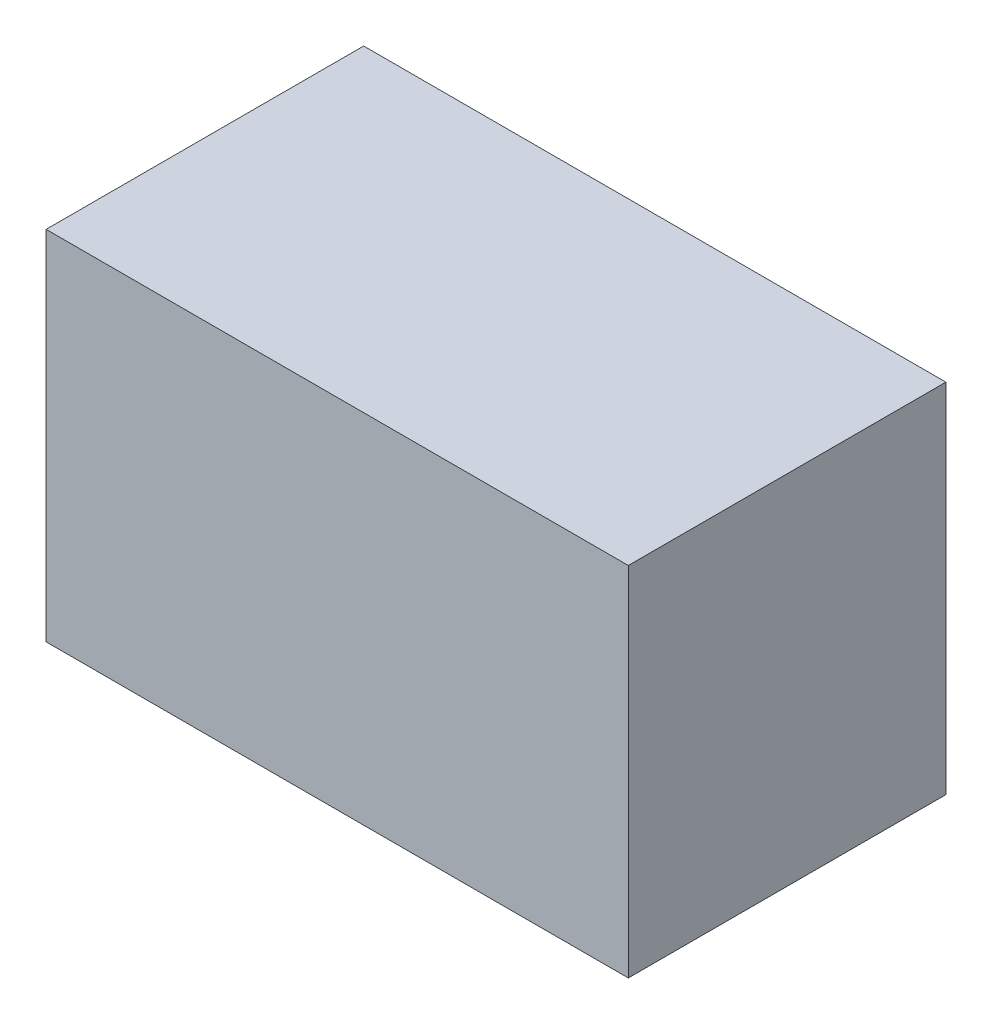
ISO-10303-21;
HEADER;
FILE_DESCRIPTION(('STEP AP214'),'2;1');
FILE_NAME('part.step','',(''),(''),'','','');
FILE_SCHEMA(('AUTOMOTIVE_DESIGN { 1 0 10303 214 1 1 1 1 }'));
ENDSEC;
DATA;
#1=APPLICATION_CONTEXT('core data for automotive mechanical design processes');
#2=APPLICATION_PROTOCOL_DEFINITION('international standard','automotive_design',2000,#1);
#3=PRODUCT_CONTEXT('',#1,'mechanical');
#4=PRODUCT('Part','Part','',(#3));
#5=PRODUCT_RELATED_PRODUCT_CATEGORY('part','',(#4));
#6=PRODUCT_DEFINITION_FORMATION('','',#4);
#7=PRODUCT_DEFINITION_CONTEXT('part definition',#1,'design');
#8=PRODUCT_DEFINITION('design','',#6,#7);
#9=PRODUCT_DEFINITION_SHAPE('','',#8);
#10=(LENGTH_UNIT() NAMED_UNIT(*) SI_UNIT(.MILLI.,.METRE.));
#11=(NAMED_UNIT(*) PLANE_ANGLE_UNIT() SI_UNIT($,.RADIAN.));
#12=(NAMED_UNIT(*) SI_UNIT($,.STERADIAN.) SOLID_ANGLE_UNIT());
#13=UNCERTAINTY_MEASURE_WITH_UNIT(LENGTH_MEASURE(1.E-05),#10,'distance_accuracy_value','');
#14=(GEOMETRIC_REPRESENTATION_CONTEXT(3) GLOBAL_UNCERTAINTY_ASSIGNED_CONTEXT((#13)) GLOBAL_UNIT_ASSIGNED_CONTEXT((#10,
#11,#12)) REPRESENTATION_CONTEXT('',''));
#15=CARTESIAN_POINT('',(0.,0.,0.));
#16=DIRECTION('',(0.,0.,1.));
#17=DIRECTION('',(1.,0.,0.));
#18=AXIS2_PLACEMENT_3D('',#15,#16,#17);
#19=CARTESIAN_POINT('',(-1.10000034,-0.67499992,1.2));
#20=DIRECTION('',(0.,0.,1.));
#21=DIRECTION('',(1.,0.,0.));
#22=AXIS2_PLACEMENT_3D('',#19,#20,#21);
#23=PLANE('',#22);
#24=DIRECTION('',(1.,0.,0.));
#25=VECTOR('',#24,1.);
#26=CARTESIAN_POINT('',(-1.10000034,0.67499992,1.2));
#27=LINE('',#26,#25);
#28=CARTESIAN_POINT('',(-1.10000034,0.67499992,1.2));
#29=VERTEX_POINT('',#28);
#30=CARTESIAN_POINT('',(1.10000034,0.67499992,1.2));
#31=VERTEX_POINT('',#30);
#32=EDGE_CURVE('E53',#29,#31,#27,.T.);
#33=ORIENTED_EDGE('',*,*,#32,.F.);
#34=DIRECTION('',(0.,1.,0.));
#35=VECTOR('',#34,1.);
#36=CARTESIAN_POINT('',(-1.10000034,-0.67499992,1.2));
#37=LINE('',#36,#35);
#38=CARTESIAN_POINT('',(-1.10000034,-0.67499992,1.2));
#39=VERTEX_POINT('',#38);
#40=EDGE_CURVE('E20',#29,#39,#37,.F.);
#41=ORIENTED_EDGE('',*,*,#40,.T.);
#42=DIRECTION('',(1.,0.,0.));
#43=VECTOR('',#42,1.);
#44=CARTESIAN_POINT('',(1.10000034,-0.67499992,1.2));
#45=LINE('',#44,#43);
#46=CARTESIAN_POINT('',(1.10000034,-0.67499992,1.2));
#47=VERTEX_POINT('',#46);
#48=EDGE_CURVE('E67',#47,#39,#45,.F.);
#49=ORIENTED_EDGE('',*,*,#48,.F.);
#50=DIRECTION('',(0.,1.,0.));
#51=VECTOR('',#50,1.);
#52=CARTESIAN_POINT('',(1.10000034,0.67499992,1.2));
#53=LINE('',#52,#51);
#54=EDGE_CURVE('E58',#31,#47,#53,.F.);
#55=ORIENTED_EDGE('',*,*,#54,.F.);
#56=EDGE_LOOP('',(#33,#41,#49,#55));
#57=FACE_BOUND('',#56,.T.);
#58=ADVANCED_FACE('F17',(#57),#23,.T.);
#59=CARTESIAN_POINT('',(1.10000034,-0.67499992,0.));
#60=DIRECTION('',(0.,-1.,0.));
#61=DIRECTION('',(0.,0.,-1.));
#62=AXIS2_PLACEMENT_3D('',#59,#60,#61);
#63=PLANE('',#62);
#64=DIRECTION('',(0.,0.,1.));
#65=VECTOR('',#64,1.);
#66=CARTESIAN_POINT('',(-1.10000034,-0.67499992,0.));
#67=LINE('',#66,#65);
#68=CARTESIAN_POINT('',(-1.10000034,-0.67499992,0.));
#69=VERTEX_POINT('',#68);
#70=EDGE_CURVE('E80',#69,#39,#67,.T.);
#71=ORIENTED_EDGE('',*,*,#70,.F.);
#72=DIRECTION('',(1.,0.,0.));
#73=VECTOR('',#72,1.);
#74=CARTESIAN_POINT('',(-1.10000034,-0.67499992,0.));
#75=LINE('',#74,#73);
#76=CARTESIAN_POINT('',(1.10000034,-0.67499992,0.));
#77=VERTEX_POINT('',#76);
#78=EDGE_CURVE('E75',#69,#77,#75,.T.);
#79=ORIENTED_EDGE('',*,*,#78,.T.);
#80=DIRECTION('',(0.,0.,-1.));
#81=VECTOR('',#80,1.);
#82=CARTESIAN_POINT('',(1.10000034,-0.67499992,0.));
#83=LINE('',#82,#81);
#84=EDGE_CURVE('E63',#47,#77,#83,.T.);
#85=ORIENTED_EDGE('',*,*,#84,.F.);
#86=ORIENTED_EDGE('',*,*,#48,.T.);
#87=EDGE_LOOP('',(#71,#79,#85,#86));
#88=FACE_BOUND('',#87,.T.);
#89=ADVANCED_FACE('F74',(#88),#63,.T.);
#90=CARTESIAN_POINT('',(1.10000034,0.67499992,0.));
#91=DIRECTION('',(1.,0.,0.));
#92=DIRECTION('',(0.,0.,-1.));
#93=AXIS2_PLACEMENT_3D('',#90,#91,#92);
#94=PLANE('',#93);
#95=ORIENTED_EDGE('',*,*,#84,.T.);
#96=DIRECTION('',(0.,1.,0.));
#97=VECTOR('',#96,1.);
#98=CARTESIAN_POINT('',(1.10000034,-0.67499992,0.));
#99=LINE('',#98,#97);
#100=CARTESIAN_POINT('',(1.10000034,0.67499992,0.));
#101=VERTEX_POINT('',#100);
#102=EDGE_CURVE('E84',#77,#101,#99,.T.);
#103=ORIENTED_EDGE('',*,*,#102,.T.);
#104=DIRECTION('',(0.,0.,1.));
#105=VECTOR('',#104,1.);
#106=CARTESIAN_POINT('',(1.10000034,0.67499992,0.));
#107=LINE('',#106,#105);
#108=EDGE_CURVE('E65',#31,#101,#107,.F.);
#109=ORIENTED_EDGE('',*,*,#108,.F.);
#110=ORIENTED_EDGE('',*,*,#54,.T.);
#111=EDGE_LOOP('',(#95,#103,#109,#110));
#112=FACE_BOUND('',#111,.T.);
#113=ADVANCED_FACE('F60',(#112),#94,.T.);
#114=CARTESIAN_POINT('',(-1.10000034,0.67499992,0.));
#115=DIRECTION('',(0.,1.,0.));
#116=DIRECTION('',(0.,0.,1.));
#117=AXIS2_PLACEMENT_3D('',#114,#115,#116);
#118=PLANE('',#117);
#119=ORIENTED_EDGE('',*,*,#108,.T.);
#120=DIRECTION('',(1.,0.,0.));
#121=VECTOR('',#120,1.);
#122=CARTESIAN_POINT('',(-1.10000034,0.67499992,0.));
#123=LINE('',#122,#121);
#124=CARTESIAN_POINT('',(-1.10000034,0.67499992,0.));
#125=VERTEX_POINT('',#124);
#126=EDGE_CURVE('E26',#101,#125,#123,.F.);
#127=ORIENTED_EDGE('',*,*,#126,.T.);
#128=DIRECTION('',(0.,0.,1.));
#129=VECTOR('',#128,1.);
#130=CARTESIAN_POINT('',(-1.10000034,0.67499992,0.));
#131=LINE('',#130,#129);
#132=EDGE_CURVE('E34',#29,#125,#131,.F.);
#133=ORIENTED_EDGE('',*,*,#132,.F.);
#134=ORIENTED_EDGE('',*,*,#32,.T.);
#135=EDGE_LOOP('',(#119,#127,#133,#134));
#136=FACE_BOUND('',#135,.T.);
#137=ADVANCED_FACE('F88',(#136),#118,.T.);
#138=CARTESIAN_POINT('',(-1.10000034,-0.67499992,0.));
#139=DIRECTION('',(-1.,0.,0.));
#140=DIRECTION('',(0.,0.,1.));
#141=AXIS2_PLACEMENT_3D('',#138,#139,#140);
#142=PLANE('',#141);
#143=ORIENTED_EDGE('',*,*,#132,.T.);
#144=DIRECTION('',(0.,1.,0.));
#145=VECTOR('',#144,1.);
#146=CARTESIAN_POINT('',(-1.10000034,-0.67499992,0.));
#147=LINE('',#146,#145);
#148=EDGE_CURVE('E11',#125,#69,#147,.F.);
#149=ORIENTED_EDGE('',*,*,#148,.T.);
#150=ORIENTED_EDGE('',*,*,#70,.T.);
#151=ORIENTED_EDGE('',*,*,#40,.F.);
#152=EDGE_LOOP('',(#143,#149,#150,#151));
#153=FACE_BOUND('',#152,.T.);
#154=ADVANCED_FACE('F91',(#153),#142,.T.);
#155=CARTESIAN_POINT('',(-1.10000034,-0.67499992,0.));
#156=DIRECTION('',(0.,0.,1.));
#157=DIRECTION('',(1.,0.,0.));
#158=AXIS2_PLACEMENT_3D('',#155,#156,#157);
#159=PLANE('',#158);
#160=ORIENTED_EDGE('',*,*,#126,.F.);
#161=ORIENTED_EDGE('',*,*,#102,.F.);
#162=ORIENTED_EDGE('',*,*,#78,.F.);
#163=ORIENTED_EDGE('',*,*,#148,.F.);
#164=EDGE_LOOP('',(#160,#161,#162,#163));
#165=FACE_BOUND('',#164,.T.);
#166=ADVANCED_FACE('F90',(#165),#159,.F.);
#167=CLOSED_SHELL('',(#58,#89,#113,#137,#154,#166));
#168=MANIFOLD_SOLID_BREP('B1',#167);
#169=ADVANCED_BREP_SHAPE_REPRESENTATION('',(#18,#168),#14);
#170=SHAPE_DEFINITION_REPRESENTATION(#9,#169);
ENDSEC;
END-ISO-10303-21;
